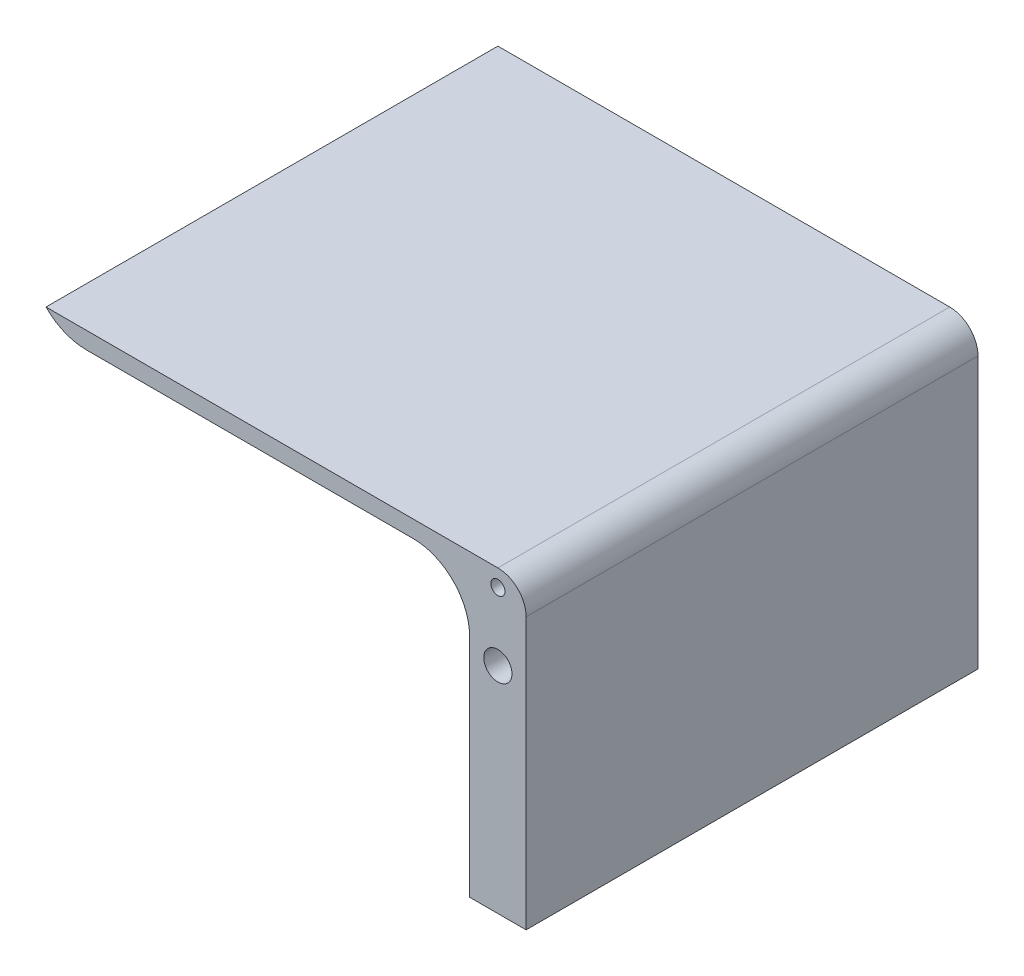
ISO-10303-21;
HEADER;
FILE_DESCRIPTION(('STEP AP214'),'2;1');
FILE_NAME('part.step','',(''),(''),'','','');
FILE_SCHEMA(('AUTOMOTIVE_DESIGN { 1 0 10303 214 1 1 1 1 }'));
ENDSEC;
DATA;
#1=APPLICATION_CONTEXT('core data for automotive mechanical design processes');
#2=APPLICATION_PROTOCOL_DEFINITION('international standard','automotive_design',2000,#1);
#3=PRODUCT_CONTEXT('',#1,'mechanical');
#4=PRODUCT('Part','Part','',(#3));
#5=PRODUCT_RELATED_PRODUCT_CATEGORY('part','',(#4));
#6=PRODUCT_DEFINITION_FORMATION('','',#4);
#7=PRODUCT_DEFINITION_CONTEXT('part definition',#1,'design');
#8=PRODUCT_DEFINITION('design','',#6,#7);
#9=PRODUCT_DEFINITION_SHAPE('','',#8);
#10=(LENGTH_UNIT() NAMED_UNIT(*) SI_UNIT(.MILLI.,.METRE.));
#11=(NAMED_UNIT(*) PLANE_ANGLE_UNIT() SI_UNIT($,.RADIAN.));
#12=(NAMED_UNIT(*) SI_UNIT($,.STERADIAN.) SOLID_ANGLE_UNIT());
#13=UNCERTAINTY_MEASURE_WITH_UNIT(LENGTH_MEASURE(1.E-05),#10,'distance_accuracy_value','');
#14=(GEOMETRIC_REPRESENTATION_CONTEXT(3) GLOBAL_UNCERTAINTY_ASSIGNED_CONTEXT((#13)) GLOBAL_UNIT_ASSIGNED_CONTEXT((#10,
#11,#12)) REPRESENTATION_CONTEXT('',''));
#15=CARTESIAN_POINT('',(0.,0.,0.));
#16=DIRECTION('',(0.,0.,1.));
#17=DIRECTION('',(1.,0.,0.));
#18=AXIS2_PLACEMENT_3D('',#15,#16,#17);
#19=CARTESIAN_POINT('',(-78.6981816468815,24.7413793103448,80.));
#20=DIRECTION('',(0.,1.,0.));
#21=DIRECTION('',(0.,0.,1.));
#22=AXIS2_PLACEMENT_3D('',#19,#20,#21);
#23=PLANE('',#22);
#24=DIRECTION('',(1.,0.,0.));
#25=VECTOR('',#24,1.);
#26=CARTESIAN_POINT('',(-78.6981816468815,24.7413793103448,80.));
#27=LINE('',#26,#25);
#28=CARTESIAN_POINT('',(-71.5567532183387,24.7413793103448,80.));
#29=VERTEX_POINT('',#28);
#30=CARTESIAN_POINT('',(-13.6981816468815,24.7413793103448,80.));
#31=VERTEX_POINT('',#30);
#32=EDGE_CURVE('E106',#29,#31,#27,.T.);
#33=ORIENTED_EDGE('',*,*,#32,.F.);
#34=DIRECTION('',(0.,0.,-1.));
#35=VECTOR('',#34,1.);
#36=CARTESIAN_POINT('',(-71.5567532183387,24.7413793103448,80.));
#37=LINE('',#36,#35);
#38=CARTESIAN_POINT('',(-71.5567532183387,24.7413793103448,0.));
#39=VERTEX_POINT('',#38);
#40=EDGE_CURVE('E161',#29,#39,#37,.T.);
#41=ORIENTED_EDGE('',*,*,#40,.T.);
#42=DIRECTION('',(1.,0.,0.));
#43=VECTOR('',#42,1.);
#44=CARTESIAN_POINT('',(-78.6981816468815,24.7413793103448,0.));
#45=LINE('',#44,#43);
#46=CARTESIAN_POINT('',(-13.6981816468815,24.7413793103448,0.));
#47=VERTEX_POINT('',#46);
#48=EDGE_CURVE('E130',#39,#47,#45,.T.);
#49=ORIENTED_EDGE('',*,*,#48,.T.);
#50=DIRECTION('',(0.,0.,-1.));
#51=VECTOR('',#50,1.);
#52=CARTESIAN_POINT('',(-13.6981816468815,24.7413793103448,80.));
#53=LINE('',#52,#51);
#54=EDGE_CURVE('E145',#47,#31,#53,.F.);
#55=ORIENTED_EDGE('',*,*,#54,.T.);
#56=EDGE_LOOP('',(#33,#41,#49,#55));
#57=FACE_BOUND('',#56,.T.);
#58=ADVANCED_FACE('F33',(#57),#23,.F.);
#59=CARTESIAN_POINT('',(-3.6981816468815,24.7413793103448,80.));
#60=DIRECTION('',(1.,0.,0.));
#61=DIRECTION('',(0.,1.,0.));
#62=AXIS2_PLACEMENT_3D('',#59,#60,#61);
#63=PLANE('',#62);
#64=DIRECTION('',(0.,-1.,0.));
#65=VECTOR('',#64,1.);
#66=CARTESIAN_POINT('',(-3.6981816468815,24.7413793103448,80.));
#67=LINE('',#66,#65);
#68=CARTESIAN_POINT('',(-3.6981816468815,14.7413793103448,80.));
#69=VERTEX_POINT('',#68);
#70=CARTESIAN_POINT('',(-3.69818164688149,-25.2586206896552,80.));
#71=VERTEX_POINT('',#70);
#72=EDGE_CURVE('E94',#69,#71,#67,.T.);
#73=ORIENTED_EDGE('',*,*,#72,.F.);
#74=DIRECTION('',(0.,0.,-1.));
#75=VECTOR('',#74,1.);
#76=CARTESIAN_POINT('',(-3.6981816468815,14.7413793103448,0.));
#77=LINE('',#76,#75);
#78=CARTESIAN_POINT('',(-3.6981816468815,14.7413793103448,0.));
#79=VERTEX_POINT('',#78);
#80=EDGE_CURVE('E116',#69,#79,#77,.T.);
#81=ORIENTED_EDGE('',*,*,#80,.T.);
#82=DIRECTION('',(0.,-1.,0.));
#83=VECTOR('',#82,1.);
#84=CARTESIAN_POINT('',(-3.6981816468815,24.7413793103448,0.));
#85=LINE('',#84,#83);
#86=CARTESIAN_POINT('',(-3.69818164688149,-25.2586206896552,0.));
#87=VERTEX_POINT('',#86);
#88=EDGE_CURVE('E112',#79,#87,#85,.T.);
#89=ORIENTED_EDGE('',*,*,#88,.T.);
#90=DIRECTION('',(0.,0.,-1.));
#91=VECTOR('',#90,1.);
#92=CARTESIAN_POINT('',(-3.69818164688149,-25.2586206896552,80.));
#93=LINE('',#92,#91);
#94=EDGE_CURVE('E109',#71,#87,#93,.T.);
#95=ORIENTED_EDGE('',*,*,#94,.F.);
#96=EDGE_LOOP('',(#73,#81,#89,#95));
#97=FACE_BOUND('',#96,.T.);
#98=ADVANCED_FACE('F110',(#97),#63,.F.);
#99=CARTESIAN_POINT('',(-3.69818164688149,-25.2586206896552,80.));
#100=DIRECTION('',(0.,1.,0.));
#101=DIRECTION('',(0.,0.,1.));
#102=AXIS2_PLACEMENT_3D('',#99,#100,#101);
#103=PLANE('',#102);
#104=DIRECTION('',(1.,0.,0.));
#105=VECTOR('',#104,1.);
#106=CARTESIAN_POINT('',(-3.69818164688149,-25.2586206896552,0.));
#107=LINE('',#106,#105);
#108=CARTESIAN_POINT('',(6.30181835311851,-25.2586206896552,0.));
#109=VERTEX_POINT('',#108);
#110=EDGE_CURVE('E134',#87,#109,#107,.T.);
#111=ORIENTED_EDGE('',*,*,#110,.T.);
#112=DIRECTION('',(0.,0.,-1.));
#113=VECTOR('',#112,1.);
#114=CARTESIAN_POINT('',(6.30181835311851,-25.2586206896552,80.));
#115=LINE('',#114,#113);
#116=CARTESIAN_POINT('',(6.30181835311851,-25.2586206896552,80.));
#117=VERTEX_POINT('',#116);
#118=EDGE_CURVE('E117',#117,#109,#115,.T.);
#119=ORIENTED_EDGE('',*,*,#118,.F.);
#120=DIRECTION('',(1.,0.,0.));
#121=VECTOR('',#120,1.);
#122=CARTESIAN_POINT('',(-3.69818164688149,-25.2586206896552,80.));
#123=LINE('',#122,#121);
#124=EDGE_CURVE('E99',#71,#117,#123,.T.);
#125=ORIENTED_EDGE('',*,*,#124,.F.);
#126=ORIENTED_EDGE('',*,*,#94,.T.);
#127=EDGE_LOOP('',(#111,#119,#125,#126));
#128=FACE_BOUND('',#127,.T.);
#129=ADVANCED_FACE('F119',(#128),#103,.F.);
#130=CARTESIAN_POINT('',(6.3018183531185,27.7413793103448,80.));
#131=DIRECTION('',(-1.,0.,0.));
#132=DIRECTION('',(0.,-1.,0.));
#133=AXIS2_PLACEMENT_3D('',#130,#131,#132);
#134=PLANE('',#133);
#135=DIRECTION('',(0.,1.,0.));
#136=VECTOR('',#135,1.);
#137=CARTESIAN_POINT('',(6.3018183531185,27.7413793103448,0.));
#138=LINE('',#137,#136);
#139=CARTESIAN_POINT('',(6.30181835311851,22.7413793103448,0.));
#140=VERTEX_POINT('',#139);
#141=EDGE_CURVE('E136',#109,#140,#138,.T.);
#142=ORIENTED_EDGE('',*,*,#141,.T.);
#143=DIRECTION('',(0.,0.,-1.));
#144=VECTOR('',#143,1.);
#145=CARTESIAN_POINT('',(6.30181835311851,22.7413793103448,80.));
#146=LINE('',#145,#144);
#147=CARTESIAN_POINT('',(6.3018183531185,22.7413793103448,80.));
#148=VERTEX_POINT('',#147);
#149=EDGE_CURVE('E157',#140,#148,#146,.F.);
#150=ORIENTED_EDGE('',*,*,#149,.T.);
#151=DIRECTION('',(0.,1.,0.));
#152=VECTOR('',#151,1.);
#153=CARTESIAN_POINT('',(6.3018183531185,24.7413793103448,80.));
#154=LINE('',#153,#152);
#155=EDGE_CURVE('E122',#117,#148,#154,.T.);
#156=ORIENTED_EDGE('',*,*,#155,.F.);
#157=ORIENTED_EDGE('',*,*,#118,.T.);
#158=EDGE_LOOP('',(#142,#150,#156,#157));
#159=FACE_BOUND('',#158,.T.);
#160=ADVANCED_FACE('F232',(#159),#134,.F.);
#161=CARTESIAN_POINT('',(-78.6981816468815,27.7413793103448,80.));
#162=DIRECTION('',(0.,-1.,0.));
#163=DIRECTION('',(0.,0.,-1.));
#164=AXIS2_PLACEMENT_3D('',#161,#162,#163);
#165=PLANE('',#164);
#166=DIRECTION('',(-1.,0.,0.));
#167=VECTOR('',#166,1.);
#168=CARTESIAN_POINT('',(-78.6981816468815,27.7413793103448,80.));
#169=LINE('',#168,#167);
#170=CARTESIAN_POINT('',(1.3018183531185,27.7413793103448,80.));
#171=VERTEX_POINT('',#170);
#172=CARTESIAN_POINT('',(-78.6981816468815,27.7413793103448,80.));
#173=VERTEX_POINT('',#172);
#174=EDGE_CURVE('E124',#171,#173,#169,.T.);
#175=ORIENTED_EDGE('',*,*,#174,.F.);
#176=DIRECTION('',(0.,0.,-1.));
#177=VECTOR('',#176,1.);
#178=CARTESIAN_POINT('',(1.3018183531185,27.7413793103448,80.));
#179=LINE('',#178,#177);
#180=CARTESIAN_POINT('',(1.3018183531185,27.7413793103448,0.));
#181=VERTEX_POINT('',#180);
#182=EDGE_CURVE('E152',#171,#181,#179,.T.);
#183=ORIENTED_EDGE('',*,*,#182,.T.);
#184=DIRECTION('',(-1.,0.,0.));
#185=VECTOR('',#184,1.);
#186=CARTESIAN_POINT('',(-78.6981816468815,27.7413793103448,0.));
#187=LINE('',#186,#185);
#188=CARTESIAN_POINT('',(-78.6981816468815,27.7413793103448,0.));
#189=VERTEX_POINT('',#188);
#190=EDGE_CURVE('E139',#181,#189,#187,.T.);
#191=ORIENTED_EDGE('',*,*,#190,.T.);
#192=DIRECTION('',(0.,0.,-1.));
#193=VECTOR('',#192,1.);
#194=CARTESIAN_POINT('',(-78.6981816468815,27.7413793103448,80.));
#195=LINE('',#194,#193);
#196=EDGE_CURVE('E129',#173,#189,#195,.T.);
#197=ORIENTED_EDGE('',*,*,#196,.F.);
#198=EDGE_LOOP('',(#175,#183,#191,#197));
#199=FACE_BOUND('',#198,.T.);
#200=ADVANCED_FACE('F169',(#199),#165,.F.);
#201=CARTESIAN_POINT('',(0.,0.,80.));
#202=DIRECTION('',(0.,0.,1.));
#203=DIRECTION('',(1.,0.,0.));
#204=AXIS2_PLACEMENT_3D('',#201,#202,#203);
#205=PLANE('',#204);
#206=CARTESIAN_POINT('',(1.30181835311851,24.7413793103448,80.));
#207=DIRECTION('',(0.,0.,1.));
#208=DIRECTION('',(1.,0.,0.));
#209=AXIS2_PLACEMENT_3D('',#206,#207,#208);
#210=CIRCLE('',#209,1.25);
#211=CARTESIAN_POINT('',(2.55181835311851,24.7413793103448,80.));
#212=VERTEX_POINT('',#211);
#213=EDGE_CURVE('E180',#212,#212,#210,.T.);
#214=ORIENTED_EDGE('',*,*,#213,.F.);
#215=EDGE_LOOP('',(#214));
#216=FACE_BOUND('',#215,.T.);
#217=CARTESIAN_POINT('',(1.30181835311851,12.7413793103448,80.));
#218=DIRECTION('',(0.,0.,1.));
#219=DIRECTION('',(1.,0.,0.));
#220=AXIS2_PLACEMENT_3D('',#217,#218,#219);
#221=CIRCLE('',#220,2.5);
#222=CARTESIAN_POINT('',(3.80181835311851,12.7413793103448,80.));
#223=VERTEX_POINT('',#222);
#224=EDGE_CURVE('E174',#223,#223,#221,.T.);
#225=ORIENTED_EDGE('',*,*,#224,.F.);
#226=EDGE_LOOP('',(#225));
#227=FACE_BOUND('',#226,.T.);
#228=ORIENTED_EDGE('',*,*,#174,.T.);
#229=CARTESIAN_POINT('',(-71.5567532183387,34.7413793103448,80.));
#230=DIRECTION('',(0.,0.,1.));
#231=DIRECTION('',(1.,0.,0.));
#232=AXIS2_PLACEMENT_3D('',#229,#230,#231);
#233=CIRCLE('',#232,10.);
#234=EDGE_CURVE('E11',#173,#29,#233,.T.);
#235=ORIENTED_EDGE('',*,*,#234,.T.);
#236=ORIENTED_EDGE('',*,*,#32,.T.);
#237=CARTESIAN_POINT('',(-13.6981816468815,14.7413793103448,80.));
#238=DIRECTION('',(0.,0.,1.));
#239=DIRECTION('',(1.,0.,0.));
#240=AXIS2_PLACEMENT_3D('',#237,#238,#239);
#241=CIRCLE('',#240,10.);
#242=EDGE_CURVE('E102',#31,#69,#241,.F.);
#243=ORIENTED_EDGE('',*,*,#242,.T.);
#244=ORIENTED_EDGE('',*,*,#72,.T.);
#245=ORIENTED_EDGE('',*,*,#124,.T.);
#246=ORIENTED_EDGE('',*,*,#155,.T.);
#247=CARTESIAN_POINT('',(1.3018183531185,22.7413793103448,80.));
#248=DIRECTION('',(0.,0.,1.));
#249=DIRECTION('',(1.,0.,0.));
#250=AXIS2_PLACEMENT_3D('',#247,#248,#249);
#251=CIRCLE('',#250,5.);
#252=EDGE_CURVE('E159',#148,#171,#251,.T.);
#253=ORIENTED_EDGE('',*,*,#252,.T.);
#254=EDGE_LOOP('',(#228,#235,#236,#243,#244,#245,#246,#253));
#255=FACE_BOUND('',#254,.T.);
#256=ADVANCED_FACE('F96',(#216,#227,#255),#205,.T.);
#257=CARTESIAN_POINT('',(0.,0.,0.));
#258=DIRECTION('',(0.,0.,1.));
#259=DIRECTION('',(1.,0.,0.));
#260=AXIS2_PLACEMENT_3D('',#257,#258,#259);
#261=PLANE('',#260);
#262=ORIENTED_EDGE('',*,*,#48,.F.);
#263=CARTESIAN_POINT('',(-71.5567532183387,34.7413793103448,0.));
#264=DIRECTION('',(0.,0.,1.));
#265=DIRECTION('',(1.,0.,0.));
#266=AXIS2_PLACEMENT_3D('',#263,#264,#265);
#267=CIRCLE('',#266,10.);
#268=EDGE_CURVE('E41',#39,#189,#267,.F.);
#269=ORIENTED_EDGE('',*,*,#268,.T.);
#270=ORIENTED_EDGE('',*,*,#190,.F.);
#271=CARTESIAN_POINT('',(1.3018183531185,22.7413793103448,0.));
#272=DIRECTION('',(0.,0.,1.));
#273=DIRECTION('',(1.,0.,0.));
#274=AXIS2_PLACEMENT_3D('',#271,#272,#273);
#275=CIRCLE('',#274,5.);
#276=EDGE_CURVE('E155',#181,#140,#275,.F.);
#277=ORIENTED_EDGE('',*,*,#276,.T.);
#278=ORIENTED_EDGE('',*,*,#141,.F.);
#279=ORIENTED_EDGE('',*,*,#110,.F.);
#280=ORIENTED_EDGE('',*,*,#88,.F.);
#281=CARTESIAN_POINT('',(-13.6981816468815,14.7413793103448,0.));
#282=DIRECTION('',(0.,0.,1.));
#283=DIRECTION('',(1.,0.,0.));
#284=AXIS2_PLACEMENT_3D('',#281,#282,#283);
#285=CIRCLE('',#284,10.);
#286=EDGE_CURVE('E148',#79,#47,#285,.T.);
#287=ORIENTED_EDGE('',*,*,#286,.T.);
#288=EDGE_LOOP('',(#262,#269,#270,#277,#278,#279,#280,#287));
#289=FACE_BOUND('',#288,.T.);
#290=ADVANCED_FACE('F165',(#289),#261,.F.);
#291=CARTESIAN_POINT('',(1.30181835311851,12.7413793103448,70.));
#292=DIRECTION('',(0.,0.,1.));
#293=DIRECTION('',(1.,0.,0.));
#294=AXIS2_PLACEMENT_3D('',#291,#292,#293);
#295=CYLINDRICAL_SURFACE('',#294,2.5);
#296=CARTESIAN_POINT('',(1.30181835311851,12.7413793103448,70.));
#297=DIRECTION('',(0.,0.,1.));
#298=DIRECTION('',(1.,0.,0.));
#299=AXIS2_PLACEMENT_3D('',#296,#297,#298);
#300=CIRCLE('',#299,2.5);
#301=CARTESIAN_POINT('',(3.80181835311851,12.7413793103448,70.));
#302=VERTEX_POINT('',#301);
#303=EDGE_CURVE('E132',#302,#302,#300,.T.);
#304=ORIENTED_EDGE('',*,*,#303,.F.);
#305=EDGE_LOOP('',(#304));
#306=FACE_BOUND('',#305,.T.);
#307=ORIENTED_EDGE('',*,*,#224,.T.);
#308=EDGE_LOOP('',(#307));
#309=FACE_BOUND('',#308,.T.);
#310=ADVANCED_FACE('F200',(#306,#309),#295,.F.);
#311=CARTESIAN_POINT('',(1.30181835311851,12.7413793103448,70.));
#312=DIRECTION('',(0.,0.,1.));
#313=DIRECTION('',(1.,0.,0.));
#314=AXIS2_PLACEMENT_3D('',#311,#312,#313);
#315=PLANE('',#314);
#316=ORIENTED_EDGE('',*,*,#303,.T.);
#317=EDGE_LOOP('',(#316));
#318=FACE_BOUND('',#317,.T.);
#319=ADVANCED_FACE('F191',(#318),#315,.T.);
#320=CARTESIAN_POINT('',(1.30181835311851,24.7413793103448,70.));
#321=DIRECTION('',(0.,0.,1.));
#322=DIRECTION('',(1.,0.,0.));
#323=AXIS2_PLACEMENT_3D('',#320,#321,#322);
#324=CYLINDRICAL_SURFACE('',#323,1.25);
#325=CARTESIAN_POINT('',(1.30181835311851,24.7413793103448,70.));
#326=DIRECTION('',(0.,0.,1.));
#327=DIRECTION('',(1.,0.,0.));
#328=AXIS2_PLACEMENT_3D('',#325,#326,#327);
#329=CIRCLE('',#328,1.25);
#330=CARTESIAN_POINT('',(2.55181835311851,24.7413793103448,70.));
#331=VERTEX_POINT('',#330);
#332=EDGE_CURVE('E177',#331,#331,#329,.T.);
#333=ORIENTED_EDGE('',*,*,#332,.F.);
#334=EDGE_LOOP('',(#333));
#335=FACE_BOUND('',#334,.T.);
#336=ORIENTED_EDGE('',*,*,#213,.T.);
#337=EDGE_LOOP('',(#336));
#338=FACE_BOUND('',#337,.T.);
#339=ADVANCED_FACE('F188',(#335,#338),#324,.F.);
#340=CARTESIAN_POINT('',(1.30181835311851,24.7413793103448,70.));
#341=DIRECTION('',(0.,0.,1.));
#342=DIRECTION('',(1.,0.,0.));
#343=AXIS2_PLACEMENT_3D('',#340,#341,#342);
#344=PLANE('',#343);
#345=ORIENTED_EDGE('',*,*,#332,.T.);
#346=EDGE_LOOP('',(#345));
#347=FACE_BOUND('',#346,.T.);
#348=ADVANCED_FACE('F186',(#347),#344,.T.);
#349=CARTESIAN_POINT('',(-13.6981816468815,14.7413793103448,80.));
#350=DIRECTION('',(0.,0.,1.));
#351=DIRECTION('',(1.,0.,0.));
#352=AXIS2_PLACEMENT_3D('',#349,#350,#351);
#353=CYLINDRICAL_SURFACE('',#352,10.);
#354=ORIENTED_EDGE('',*,*,#242,.F.);
#355=ORIENTED_EDGE('',*,*,#54,.F.);
#356=ORIENTED_EDGE('',*,*,#286,.F.);
#357=ORIENTED_EDGE('',*,*,#80,.F.);
#358=EDGE_LOOP('',(#354,#355,#356,#357));
#359=FACE_BOUND('',#358,.T.);
#360=ADVANCED_FACE('F220',(#359),#353,.F.);
#361=CARTESIAN_POINT('',(1.3018183531185,22.7413793103448,80.));
#362=DIRECTION('',(0.,0.,-1.));
#363=DIRECTION('',(-1.,0.,0.));
#364=AXIS2_PLACEMENT_3D('',#361,#362,#363);
#365=CYLINDRICAL_SURFACE('',#364,5.);
#366=ORIENTED_EDGE('',*,*,#252,.F.);
#367=ORIENTED_EDGE('',*,*,#149,.F.);
#368=ORIENTED_EDGE('',*,*,#276,.F.);
#369=ORIENTED_EDGE('',*,*,#182,.F.);
#370=EDGE_LOOP('',(#366,#367,#368,#369));
#371=FACE_BOUND('',#370,.T.);
#372=ADVANCED_FACE('F222',(#371),#365,.T.);
#373=CARTESIAN_POINT('',(-71.5567532183387,34.7413793103448,80.));
#374=DIRECTION('',(0.,0.,-1.));
#375=DIRECTION('',(-1.,0.,0.));
#376=AXIS2_PLACEMENT_3D('',#373,#374,#375);
#377=CYLINDRICAL_SURFACE('',#376,10.);
#378=ORIENTED_EDGE('',*,*,#234,.F.);
#379=ORIENTED_EDGE('',*,*,#196,.T.);
#380=ORIENTED_EDGE('',*,*,#268,.F.);
#381=ORIENTED_EDGE('',*,*,#40,.F.);
#382=EDGE_LOOP('',(#378,#379,#380,#381));
#383=FACE_BOUND('',#382,.T.);
#384=ADVANCED_FACE('F35',(#383),#377,.T.);
#385=CLOSED_SHELL('',(#58,#98,#129,#160,#200,#256,#290,#310,#319,#339,#348,#360,#372,#384));
#386=MANIFOLD_SOLID_BREP('B2',#385);
#387=ADVANCED_BREP_SHAPE_REPRESENTATION('',(#18,#386),#14);
#388=SHAPE_DEFINITION_REPRESENTATION(#9,#387);
ENDSEC;
END-ISO-10303-21;
